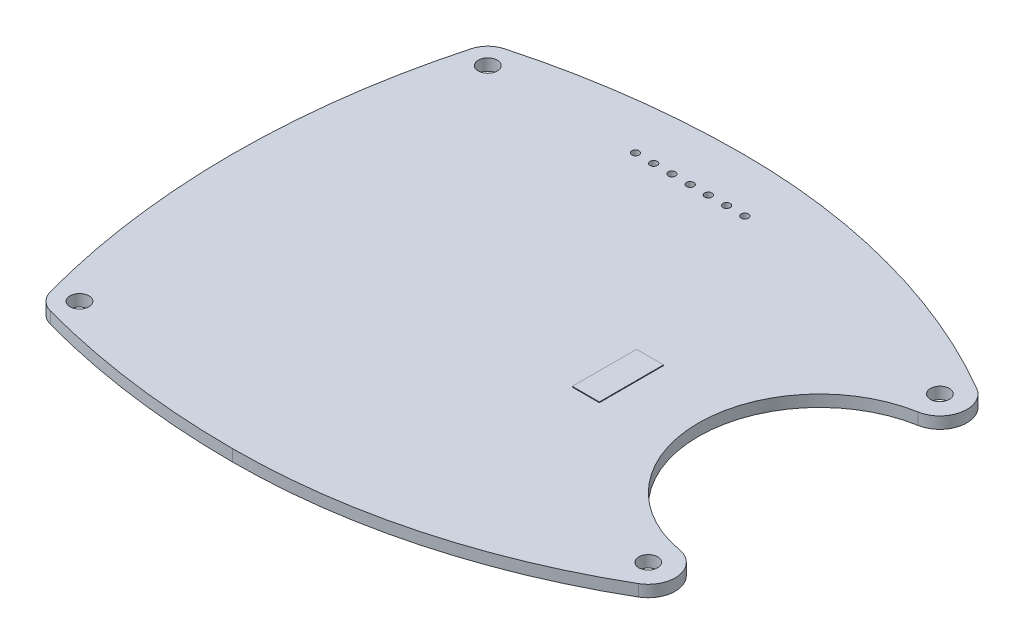
ISO-10303-21;
HEADER;
FILE_DESCRIPTION(('STEP AP214'),'2;1');
FILE_NAME('part.step','',(''),(''),'','','');
FILE_SCHEMA(('AUTOMOTIVE_DESIGN { 1 0 10303 214 1 1 1 1 }'));
ENDSEC;
DATA;
#1=APPLICATION_CONTEXT('core data for automotive mechanical design processes');
#2=APPLICATION_PROTOCOL_DEFINITION('international standard','automotive_design',2000,#1);
#3=PRODUCT_CONTEXT('',#1,'mechanical');
#4=PRODUCT('Part','Part','',(#3));
#5=PRODUCT_RELATED_PRODUCT_CATEGORY('part','',(#4));
#6=PRODUCT_DEFINITION_FORMATION('','',#4);
#7=PRODUCT_DEFINITION_CONTEXT('part definition',#1,'design');
#8=PRODUCT_DEFINITION('design','',#6,#7);
#9=PRODUCT_DEFINITION_SHAPE('','',#8);
#10=(LENGTH_UNIT() NAMED_UNIT(*) SI_UNIT(.MILLI.,.METRE.));
#11=(NAMED_UNIT(*) PLANE_ANGLE_UNIT() SI_UNIT($,.RADIAN.));
#12=(NAMED_UNIT(*) SI_UNIT($,.STERADIAN.) SOLID_ANGLE_UNIT());
#13=UNCERTAINTY_MEASURE_WITH_UNIT(LENGTH_MEASURE(1.E-05),#10,'distance_accuracy_value','');
#14=(GEOMETRIC_REPRESENTATION_CONTEXT(3) GLOBAL_UNCERTAINTY_ASSIGNED_CONTEXT((#13)) GLOBAL_UNIT_ASSIGNED_CONTEXT((#10,
#11,#12)) REPRESENTATION_CONTEXT('',''));
#15=CARTESIAN_POINT('',(0.,0.,0.));
#16=DIRECTION('',(0.,0.,1.));
#17=DIRECTION('',(1.,0.,0.));
#18=AXIS2_PLACEMENT_3D('',#15,#16,#17);
#19=CARTESIAN_POINT('',(0.,1.7,0.));
#20=DIRECTION('',(0.,-1.,0.));
#21=DIRECTION('',(0.,0.,-1.));
#22=AXIS2_PLACEMENT_3D('',#19,#20,#21);
#23=PLANE('',#22);
#24=DIRECTION('',(0.,0.,-1.));
#25=VECTOR('',#24,1.);
#26=CARTESIAN_POINT('',(16.,1.7,4.4));
#27=LINE('',#26,#25);
#28=CARTESIAN_POINT('',(16.,1.7,4.4));
#29=VERTEX_POINT('',#28);
#30=CARTESIAN_POINT('',(16.,1.7,-4.4));
#31=VERTEX_POINT('',#30);
#32=EDGE_CURVE('E214',#29,#31,#27,.T.);
#33=ORIENTED_EDGE('',*,*,#32,.F.);
#34=DIRECTION('',(-1.,0.,0.));
#35=VECTOR('',#34,1.);
#36=CARTESIAN_POINT('',(16.,1.7,4.4));
#37=LINE('',#36,#35);
#38=CARTESIAN_POINT('',(19.7,1.7,4.4));
#39=VERTEX_POINT('',#38);
#40=EDGE_CURVE('E219',#39,#29,#37,.T.);
#41=ORIENTED_EDGE('',*,*,#40,.F.);
#42=DIRECTION('',(0.,0.,1.));
#43=VECTOR('',#42,1.);
#44=CARTESIAN_POINT('',(19.7,1.7,4.4));
#45=LINE('',#44,#43);
#46=CARTESIAN_POINT('',(19.7,1.7,-4.4));
#47=VERTEX_POINT('',#46);
#48=EDGE_CURVE('E224',#47,#39,#45,.T.);
#49=ORIENTED_EDGE('',*,*,#48,.F.);
#50=DIRECTION('',(1.,0.,0.));
#51=VECTOR('',#50,1.);
#52=CARTESIAN_POINT('',(16.,1.7,-4.4));
#53=LINE('',#52,#51);
#54=EDGE_CURVE('E208',#31,#47,#53,.T.);
#55=ORIENTED_EDGE('',*,*,#54,.F.);
#56=EDGE_LOOP('',(#33,#41,#49,#55));
#57=FACE_BOUND('',#56,.T.);
#58=ADVANCED_FACE('F16',(#57),#23,.F.);
#59=CARTESIAN_POINT('',(0.,-3.,0.));
#60=DIRECTION('',(0.,1.,0.));
#61=DIRECTION('',(0.,0.,1.));
#62=AXIS2_PLACEMENT_3D('',#59,#60,#61);
#63=PLANE('',#62);
#64=DIRECTION('',(0.,0.,-1.));
#65=VECTOR('',#64,1.);
#66=CARTESIAN_POINT('',(11.002365618,-3.,-5.5));
#67=LINE('',#66,#65);
#68=CARTESIAN_POINT('',(11.002365618,-3.,-5.5));
#69=VERTEX_POINT('',#68);
#70=CARTESIAN_POINT('',(11.002365618,-3.,5.5));
#71=VERTEX_POINT('',#70);
#72=EDGE_CURVE('E165',#69,#71,#67,.F.);
#73=ORIENTED_EDGE('',*,*,#72,.F.);
#74=DIRECTION('',(1.,0.,0.));
#75=VECTOR('',#74,1.);
#76=CARTESIAN_POINT('',(11.002365618,-3.,-5.5));
#77=LINE('',#76,#75);
#78=CARTESIAN_POINT('',(16.002365618,-3.,-5.5));
#79=VERTEX_POINT('',#78);
#80=EDGE_CURVE('E177',#79,#69,#77,.F.);
#81=ORIENTED_EDGE('',*,*,#80,.F.);
#82=DIRECTION('',(0.,0.,1.));
#83=VECTOR('',#82,1.);
#84=CARTESIAN_POINT('',(16.002365618,-3.,-5.5));
#85=LINE('',#84,#83);
#86=CARTESIAN_POINT('',(16.002365618,-3.,5.5));
#87=VERTEX_POINT('',#86);
#88=EDGE_CURVE('E182',#87,#79,#85,.F.);
#89=ORIENTED_EDGE('',*,*,#88,.F.);
#90=DIRECTION('',(-1.,0.,0.));
#91=VECTOR('',#90,1.);
#92=CARTESIAN_POINT('',(11.002365618,-3.,5.5));
#93=LINE('',#92,#91);
#94=EDGE_CURVE('E148',#71,#87,#93,.F.);
#95=ORIENTED_EDGE('',*,*,#94,.F.);
#96=EDGE_LOOP('',(#73,#81,#89,#95));
#97=FACE_BOUND('',#96,.T.);
#98=ADVANCED_FACE('F472',(#97),#63,.F.);
#99=CARTESIAN_POINT('',(19.7,1.7,4.4));
#100=DIRECTION('',(-1.,0.,0.));
#101=DIRECTION('',(0.,0.,1.));
#102=AXIS2_PLACEMENT_3D('',#99,#100,#101);
#103=PLANE('',#102);
#104=ORIENTED_EDGE('',*,*,#48,.T.);
#105=DIRECTION('',(0.,1.,0.));
#106=VECTOR('',#105,1.);
#107=CARTESIAN_POINT('',(19.7,1.7,4.4));
#108=LINE('',#107,#106);
#109=CARTESIAN_POINT('',(19.7,1.6,4.4));
#110=VERTEX_POINT('',#109);
#111=EDGE_CURVE('E221',#110,#39,#108,.T.);
#112=ORIENTED_EDGE('',*,*,#111,.F.);
#113=DIRECTION('',(0.,0.,-1.));
#114=VECTOR('',#113,1.);
#115=CARTESIAN_POINT('',(19.7,1.6,-23.329166667));
#116=LINE('',#115,#114);
#117=CARTESIAN_POINT('',(19.7,1.6,-4.4));
#118=VERTEX_POINT('',#117);
#119=EDGE_CURVE('E173',#118,#110,#116,.F.);
#120=ORIENTED_EDGE('',*,*,#119,.F.);
#121=DIRECTION('',(0.,1.,0.));
#122=VECTOR('',#121,1.);
#123=CARTESIAN_POINT('',(19.7,1.7,-4.4));
#124=LINE('',#123,#122);
#125=EDGE_CURVE('E205',#47,#118,#124,.F.);
#126=ORIENTED_EDGE('',*,*,#125,.F.);
#127=EDGE_LOOP('',(#104,#112,#120,#126));
#128=FACE_BOUND('',#127,.T.);
#129=ADVANCED_FACE('F469',(#128),#103,.F.);
#130=CARTESIAN_POINT('',(16.,1.7,4.4));
#131=DIRECTION('',(0.,0.,-1.));
#132=DIRECTION('',(-1.,0.,0.));
#133=AXIS2_PLACEMENT_3D('',#130,#131,#132);
#134=PLANE('',#133);
#135=ORIENTED_EDGE('',*,*,#40,.T.);
#136=DIRECTION('',(0.,1.,0.));
#137=VECTOR('',#136,1.);
#138=CARTESIAN_POINT('',(16.,1.7,4.4));
#139=LINE('',#138,#137);
#140=CARTESIAN_POINT('',(16.,1.6,4.4));
#141=VERTEX_POINT('',#140);
#142=EDGE_CURVE('E216',#141,#29,#139,.T.);
#143=ORIENTED_EDGE('',*,*,#142,.F.);
#144=DIRECTION('',(1.,0.,0.));
#145=VECTOR('',#144,1.);
#146=CARTESIAN_POINT('',(-14.,1.6,4.4));
#147=LINE('',#146,#145);
#148=EDGE_CURVE('E497',#110,#141,#147,.F.);
#149=ORIENTED_EDGE('',*,*,#148,.F.);
#150=ORIENTED_EDGE('',*,*,#111,.T.);
#151=EDGE_LOOP('',(#135,#143,#149,#150));
#152=FACE_BOUND('',#151,.T.);
#153=ADVANCED_FACE('F465',(#152),#134,.F.);
#154=CARTESIAN_POINT('',(16.,1.7,4.4));
#155=DIRECTION('',(1.,0.,0.));
#156=DIRECTION('',(0.,0.,-1.));
#157=AXIS2_PLACEMENT_3D('',#154,#155,#156);
#158=PLANE('',#157);
#159=ORIENTED_EDGE('',*,*,#32,.T.);
#160=DIRECTION('',(0.,1.,0.));
#161=VECTOR('',#160,1.);
#162=CARTESIAN_POINT('',(16.,1.7,-4.4));
#163=LINE('',#162,#161);
#164=CARTESIAN_POINT('',(16.,1.6,-4.4));
#165=VERTEX_POINT('',#164);
#166=EDGE_CURVE('E211',#165,#31,#163,.T.);
#167=ORIENTED_EDGE('',*,*,#166,.F.);
#168=DIRECTION('',(0.,0.,-1.));
#169=VECTOR('',#168,1.);
#170=CARTESIAN_POINT('',(16.,1.6,-23.329166667));
#171=LINE('',#170,#169);
#172=EDGE_CURVE('E495',#141,#165,#171,.T.);
#173=ORIENTED_EDGE('',*,*,#172,.F.);
#174=ORIENTED_EDGE('',*,*,#142,.T.);
#175=EDGE_LOOP('',(#159,#167,#173,#174));
#176=FACE_BOUND('',#175,.T.);
#177=ADVANCED_FACE('F461',(#176),#158,.F.);
#178=CARTESIAN_POINT('',(16.,1.7,-4.4));
#179=DIRECTION('',(0.,0.,1.));
#180=DIRECTION('',(1.,0.,0.));
#181=AXIS2_PLACEMENT_3D('',#178,#179,#180);
#182=PLANE('',#181);
#183=ORIENTED_EDGE('',*,*,#54,.T.);
#184=ORIENTED_EDGE('',*,*,#125,.T.);
#185=DIRECTION('',(1.,0.,0.));
#186=VECTOR('',#185,1.);
#187=CARTESIAN_POINT('',(-14.,1.6,-4.4));
#188=LINE('',#187,#186);
#189=EDGE_CURVE('E287',#165,#118,#188,.T.);
#190=ORIENTED_EDGE('',*,*,#189,.F.);
#191=ORIENTED_EDGE('',*,*,#166,.T.);
#192=EDGE_LOOP('',(#183,#184,#190,#191));
#193=FACE_BOUND('',#192,.T.);
#194=ADVANCED_FACE('F458',(#193),#182,.F.);
#195=CARTESIAN_POINT('',(0.,0.,-74.658333333));
#196=DIRECTION('',(0.,-1.,0.));
#197=DIRECTION('',(0.,0.,-1.));
#198=AXIS2_PLACEMENT_3D('',#195,#196,#197);
#199=CYLINDRICAL_SURFACE('',#198,109.658333334);
#200=CARTESIAN_POINT('',(0.,1.6000000003412,-74.658333333));
#201=DIRECTION('',(0.,-1.,0.));
#202=DIRECTION('',(0.,0.,-1.));
#203=AXIS2_PLACEMENT_3D('',#200,#201,#202);
#204=CIRCLE('',#203,109.658333334);
#205=CARTESIAN_POINT('',(-28.8551961782056,1.60000000016539,31.1354647980793));
#206=VERTEX_POINT('',#205);
#207=CARTESIAN_POINT('',(0.,1.60000000036999,35.000000001));
#208=VERTEX_POINT('',#207);
#209=EDGE_CURVE('E19',#206,#208,#204,.F.);
#210=ORIENTED_EDGE('',*,*,#209,.F.);
#211=DIRECTION('',(0.,1.,0.));
#212=VECTOR('',#211,1.);
#213=CARTESIAN_POINT('',(-28.8551961779043,0.8,31.1354647976493));
#214=LINE('',#213,#212);
#215=CARTESIAN_POINT('',(-28.8551961780756,1.65387491573494E-10,31.1354647976026));
#216=VERTEX_POINT('',#215);
#217=EDGE_CURVE('E203',#216,#206,#214,.T.);
#218=ORIENTED_EDGE('',*,*,#217,.F.);
#219=CARTESIAN_POINT('',(0.,3.41196038436409E-10,-74.658333333));
#220=DIRECTION('',(0.,-1.,0.));
#221=DIRECTION('',(0.,0.,-1.));
#222=AXIS2_PLACEMENT_3D('',#219,#220,#221);
#223=CIRCLE('',#222,109.658333334);
#224=CARTESIAN_POINT('',(0.,3.69995575651017E-10,35.000000001));
#225=VERTEX_POINT('',#224);
#226=EDGE_CURVE('E144',#225,#216,#223,.T.);
#227=ORIENTED_EDGE('',*,*,#226,.F.);
#228=DIRECTION('',(0.,-1.,0.));
#229=VECTOR('',#228,1.);
#230=CARTESIAN_POINT('',(0.,0.8,35.000000001));
#231=LINE('',#230,#229);
#232=EDGE_CURVE('E140',#208,#225,#231,.T.);
#233=ORIENTED_EDGE('',*,*,#232,.F.);
#234=EDGE_LOOP('',(#210,#218,#227,#233));
#235=FACE_BOUND('',#234,.T.);
#236=ADVANCED_FACE('F142',(#235),#199,.T.);
#237=CARTESIAN_POINT('',(-28.,0.,28.));
#238=DIRECTION('',(0.,-1.,0.));
#239=DIRECTION('',(0.,0.,-1.));
#240=AXIS2_PLACEMENT_3D('',#237,#238,#239);
#241=CYLINDRICAL_SURFACE('',#240,3.25);
#242=CARTESIAN_POINT('',(-28.,1.6,28.));
#243=DIRECTION('',(0.,-1.,0.));
#244=DIRECTION('',(0.,0.,-1.));
#245=AXIS2_PLACEMENT_3D('',#242,#243,#244);
#246=CIRCLE('',#245,3.25);
#247=CARTESIAN_POINT('',(-31.1354647975969,1.6,28.855196178074));
#248=VERTEX_POINT('',#247);
#249=EDGE_CURVE('E162',#248,#206,#246,.F.);
#250=ORIENTED_EDGE('',*,*,#249,.F.);
#251=DIRECTION('',(0.,1.,0.));
#252=VECTOR('',#251,1.);
#253=CARTESIAN_POINT('',(-31.1354647976379,0.8,28.8551961779013));
#254=LINE('',#253,#252);
#255=CARTESIAN_POINT('',(-31.1354647975912,0.,28.8551961780725));
#256=VERTEX_POINT('',#255);
#257=EDGE_CURVE('E201',#256,#248,#254,.T.);
#258=ORIENTED_EDGE('',*,*,#257,.F.);
#259=CARTESIAN_POINT('',(-28.,0.,28.));
#260=DIRECTION('',(0.,-1.,0.));
#261=DIRECTION('',(0.,0.,-1.));
#262=AXIS2_PLACEMENT_3D('',#259,#260,#261);
#263=CIRCLE('',#262,3.25);
#264=EDGE_CURVE('E283',#216,#256,#263,.T.);
#265=ORIENTED_EDGE('',*,*,#264,.F.);
#266=ORIENTED_EDGE('',*,*,#217,.T.);
#267=EDGE_LOOP('',(#250,#258,#265,#266));
#268=FACE_BOUND('',#267,.T.);
#269=ADVANCED_FACE('F365',(#268),#241,.T.);
#270=CARTESIAN_POINT('',(74.658333333,0.,0.));
#271=DIRECTION('',(0.,-1.,0.));
#272=DIRECTION('',(0.,0.,-1.));
#273=AXIS2_PLACEMENT_3D('',#270,#271,#272);
#274=CYLINDRICAL_SURFACE('',#273,109.658333333);
#275=CARTESIAN_POINT('',(74.658333333,1.6,0.));
#276=DIRECTION('',(0.,-1.,0.));
#277=DIRECTION('',(0.,0.,-1.));
#278=AXIS2_PLACEMENT_3D('',#275,#276,#277);
#279=CIRCLE('',#278,109.658333333);
#280=CARTESIAN_POINT('',(-31.1354647975969,1.6,-28.855196178074));
#281=VERTEX_POINT('',#280);
#282=EDGE_CURVE('E319',#281,#248,#279,.F.);
#283=ORIENTED_EDGE('',*,*,#282,.F.);
#284=DIRECTION('',(0.,1.,0.));
#285=VECTOR('',#284,1.);
#286=CARTESIAN_POINT('',(-31.1354647976493,0.8,-28.8551961779043));
#287=LINE('',#286,#285);
#288=CARTESIAN_POINT('',(-31.1354647976026,0.,-28.8551961780756));
#289=VERTEX_POINT('',#288);
#290=EDGE_CURVE('E199',#289,#281,#287,.T.);
#291=ORIENTED_EDGE('',*,*,#290,.F.);
#292=CARTESIAN_POINT('',(74.658333333,0.,0.));
#293=DIRECTION('',(0.,-1.,0.));
#294=DIRECTION('',(0.,0.,-1.));
#295=AXIS2_PLACEMENT_3D('',#292,#293,#294);
#296=CIRCLE('',#295,109.658333333);
#297=EDGE_CURVE('E280',#256,#289,#296,.T.);
#298=ORIENTED_EDGE('',*,*,#297,.F.);
#299=ORIENTED_EDGE('',*,*,#257,.T.);
#300=EDGE_LOOP('',(#283,#291,#298,#299));
#301=FACE_BOUND('',#300,.T.);
#302=ADVANCED_FACE('F361',(#301),#274,.T.);
#303=CARTESIAN_POINT('',(-28.,0.,-28.));
#304=DIRECTION('',(0.,-1.,0.));
#305=DIRECTION('',(0.,0.,-1.));
#306=AXIS2_PLACEMENT_3D('',#303,#304,#305);
#307=CYLINDRICAL_SURFACE('',#306,3.25);
#308=CARTESIAN_POINT('',(-28.,1.6,-28.));
#309=DIRECTION('',(0.,-1.,0.));
#310=DIRECTION('',(0.,0.,-1.));
#311=AXIS2_PLACEMENT_3D('',#308,#309,#310);
#312=CIRCLE('',#311,3.25);
#313=CARTESIAN_POINT('',(-28.855196178074,1.59999999983844,-31.1354647975969));
#314=VERTEX_POINT('',#313);
#315=EDGE_CURVE('E321',#314,#281,#312,.F.);
#316=ORIENTED_EDGE('',*,*,#315,.F.);
#317=DIRECTION('',(0.,1.,0.));
#318=VECTOR('',#317,1.);
#319=CARTESIAN_POINT('',(-28.8551961779013,0.8,-31.1354647976379));
#320=LINE('',#319,#318);
#321=CARTESIAN_POINT('',(-28.8551961780725,-1.61557433145747E-10,-31.1354647975912));
#322=VERTEX_POINT('',#321);
#323=EDGE_CURVE('E197',#322,#314,#320,.T.);
#324=ORIENTED_EDGE('',*,*,#323,.F.);
#325=CARTESIAN_POINT('',(-28.,0.,-28.));
#326=DIRECTION('',(0.,-1.,0.));
#327=DIRECTION('',(0.,0.,-1.));
#328=AXIS2_PLACEMENT_3D('',#325,#326,#327);
#329=CIRCLE('',#328,3.25);
#330=EDGE_CURVE('E277',#289,#322,#329,.T.);
#331=ORIENTED_EDGE('',*,*,#330,.F.);
#332=ORIENTED_EDGE('',*,*,#290,.T.);
#333=EDGE_LOOP('',(#316,#324,#331,#332));
#334=FACE_BOUND('',#333,.T.);
#335=ADVANCED_FACE('F358',(#334),#307,.T.);
#336=CARTESIAN_POINT('',(0.,0.,74.658333333));
#337=DIRECTION('',(0.,-1.,0.));
#338=DIRECTION('',(0.,0.,-1.));
#339=AXIS2_PLACEMENT_3D('',#336,#337,#338);
#340=CYLINDRICAL_SURFACE('',#339,109.658333333);
#341=CARTESIAN_POINT('',(0.,1.5999999996667,74.658333333));
#342=DIRECTION('',(0.,-1.,0.));
#343=DIRECTION('',(0.,0.,-1.));
#344=AXIS2_PLACEMENT_3D('',#341,#342,#343);
#345=CIRCLE('',#344,109.658333333);
#346=CARTESIAN_POINT('',(0.,1.59999999961845,-35.));
#347=VERTEX_POINT('',#346);
#348=EDGE_CURVE('E324',#347,#314,#345,.F.);
#349=ORIENTED_EDGE('',*,*,#348,.F.);
#350=DIRECTION('',(0.,1.,0.));
#351=VECTOR('',#350,1.);
#352=CARTESIAN_POINT('',(0.,0.8,-35.));
#353=LINE('',#352,#351);
#354=CARTESIAN_POINT('',(0.,-3.81550445607022E-10,-35.));
#355=VERTEX_POINT('',#354);
#356=EDGE_CURVE('E195',#355,#347,#353,.T.);
#357=ORIENTED_EDGE('',*,*,#356,.F.);
#358=CARTESIAN_POINT('',(0.,-3.33294589843769E-10,74.658333333));
#359=DIRECTION('',(0.,-1.,0.));
#360=DIRECTION('',(0.,0.,-1.));
#361=AXIS2_PLACEMENT_3D('',#358,#359,#360);
#362=CIRCLE('',#361,109.658333333);
#363=EDGE_CURVE('E274',#322,#355,#362,.T.);
#364=ORIENTED_EDGE('',*,*,#363,.F.);
#365=ORIENTED_EDGE('',*,*,#323,.T.);
#366=EDGE_LOOP('',(#349,#357,#364,#365));
#367=FACE_BOUND('',#366,.T.);
#368=ADVANCED_FACE('F354',(#367),#340,.T.);
#369=CARTESIAN_POINT('',(0.,0.,52.389705882));
#370=DIRECTION('',(0.,-1.,0.));
#371=DIRECTION('',(0.,0.,-1.));
#372=AXIS2_PLACEMENT_3D('',#369,#370,#371);
#373=CYLINDRICAL_SURFACE('',#372,87.389705882);
#374=CARTESIAN_POINT('',(0.,1.5999999996471,52.389705882));
#375=DIRECTION('',(0.,-1.,0.));
#376=DIRECTION('',(0.,0.,-1.));
#377=AXIS2_PLACEMENT_3D('',#374,#375,#376);
#378=CIRCLE('',#377,87.389705882);
#379=CARTESIAN_POINT('',(43.8559116820076,1.59999999983135,-23.1987833522387));
#380=VERTEX_POINT('',#379);
#381=EDGE_CURVE('E327',#380,#347,#378,.F.);
#382=ORIENTED_EDGE('',*,*,#381,.F.);
#383=DIRECTION('',(0.,1.,0.));
#384=VECTOR('',#383,1.);
#385=CARTESIAN_POINT('',(43.855911682198,0.8,-23.1987833523412));
#386=LINE('',#385,#384);
#387=CARTESIAN_POINT('',(43.8559116821001,-1.68649853062362E-10,-23.198783352398));
#388=VERTEX_POINT('',#387);
#389=EDGE_CURVE('E193',#388,#380,#386,.T.);
#390=ORIENTED_EDGE('',*,*,#389,.F.);
#391=CARTESIAN_POINT('',(0.,-3.52893495675355E-10,52.389705882));
#392=DIRECTION('',(0.,-1.,0.));
#393=DIRECTION('',(0.,0.,-1.));
#394=AXIS2_PLACEMENT_3D('',#391,#392,#393);
#395=CIRCLE('',#394,87.389705882);
#396=EDGE_CURVE('E271',#355,#388,#395,.T.);
#397=ORIENTED_EDGE('',*,*,#396,.F.);
#398=ORIENTED_EDGE('',*,*,#356,.T.);
#399=EDGE_LOOP('',(#382,#390,#397,#398));
#400=FACE_BOUND('',#399,.T.);
#401=ADVANCED_FACE('F350',(#400),#373,.T.);
#402=CARTESIAN_POINT('',(42.,0.,-20.));
#403=DIRECTION('',(0.,-1.,0.));
#404=DIRECTION('',(0.,0.,-1.));
#405=AXIS2_PLACEMENT_3D('',#402,#403,#404);
#406=CYLINDRICAL_SURFACE('',#405,3.69819187);
#407=CARTESIAN_POINT('',(42.,1.6,-20.));
#408=DIRECTION('',(0.,-1.,0.));
#409=DIRECTION('',(0.,0.,-1.));
#410=AXIS2_PLACEMENT_3D('',#407,#408,#409);
#411=CIRCLE('',#410,3.69819187);
#412=CARTESIAN_POINT('',(42.6374955411872,1.6,-16.3571683350015));
#413=VERTEX_POINT('',#412);
#414=EDGE_CURVE('E330',#413,#380,#411,.F.);
#415=ORIENTED_EDGE('',*,*,#414,.F.);
#416=DIRECTION('',(0.,1.,0.));
#417=VECTOR('',#416,1.);
#418=CARTESIAN_POINT('',(42.6374955409404,0.8,-16.3571683353406));
#419=LINE('',#418,#417);
#420=CARTESIAN_POINT('',(42.6374955411223,0.,-16.3571683353724));
#421=VERTEX_POINT('',#420);
#422=EDGE_CURVE('E191',#421,#413,#419,.T.);
#423=ORIENTED_EDGE('',*,*,#422,.F.);
#424=CARTESIAN_POINT('',(42.,0.,-20.));
#425=DIRECTION('',(0.,-1.,0.));
#426=DIRECTION('',(0.,0.,-1.));
#427=AXIS2_PLACEMENT_3D('',#424,#425,#426);
#428=CIRCLE('',#427,3.69819187);
#429=EDGE_CURVE('E268',#388,#421,#428,.T.);
#430=ORIENTED_EDGE('',*,*,#429,.F.);
#431=ORIENTED_EDGE('',*,*,#389,.T.);
#432=EDGE_LOOP('',(#415,#423,#430,#431));
#433=FACE_BOUND('',#432,.T.);
#434=ADVANCED_FACE('F346',(#433),#406,.T.);
#435=CARTESIAN_POINT('',(45.5,1.6,0.));
#436=DIRECTION('',(0.,-1.,0.));
#437=DIRECTION('',(0.,0.,-1.));
#438=AXIS2_PLACEMENT_3D('',#435,#436,#437);
#439=CYLINDRICAL_SURFACE('',#438,16.605748635);
#440=CARTESIAN_POINT('',(45.5,1.6,0.));
#441=DIRECTION('',(0.,-1.,0.));
#442=DIRECTION('',(0.,0.,-1.));
#443=AXIS2_PLACEMENT_3D('',#440,#441,#442);
#444=CIRCLE('',#443,16.605748635);
#445=CARTESIAN_POINT('',(42.6374955411872,1.6,16.3571683350015));
#446=VERTEX_POINT('',#445);
#447=EDGE_CURVE('E333',#446,#413,#444,.T.);
#448=ORIENTED_EDGE('',*,*,#447,.F.);
#449=DIRECTION('',(0.,1.,0.));
#450=VECTOR('',#449,1.);
#451=CARTESIAN_POINT('',(42.6374955410702,0.8,16.3571683345988));
#452=LINE('',#451,#450);
#453=CARTESIAN_POINT('',(42.6374955412521,0.,16.3571683346306));
#454=VERTEX_POINT('',#453);
#455=EDGE_CURVE('E189',#454,#446,#452,.T.);
#456=ORIENTED_EDGE('',*,*,#455,.F.);
#457=CARTESIAN_POINT('',(45.5,0.,0.));
#458=DIRECTION('',(0.,-1.,0.));
#459=DIRECTION('',(0.,0.,-1.));
#460=AXIS2_PLACEMENT_3D('',#457,#458,#459);
#461=CIRCLE('',#460,16.605748635);
#462=EDGE_CURVE('E265',#421,#454,#461,.F.);
#463=ORIENTED_EDGE('',*,*,#462,.F.);
#464=ORIENTED_EDGE('',*,*,#422,.T.);
#465=EDGE_LOOP('',(#448,#456,#463,#464));
#466=FACE_BOUND('',#465,.T.);
#467=ADVANCED_FACE('F342',(#466),#439,.F.);
#468=CARTESIAN_POINT('',(42.,0.,20.));
#469=DIRECTION('',(0.,-1.,0.));
#470=DIRECTION('',(0.,0.,-1.));
#471=AXIS2_PLACEMENT_3D('',#468,#469,#470);
#472=CYLINDRICAL_SURFACE('',#471,3.69819187);
#473=CARTESIAN_POINT('',(42.,1.6,20.));
#474=DIRECTION('',(0.,-1.,0.));
#475=DIRECTION('',(0.,0.,-1.));
#476=AXIS2_PLACEMENT_3D('',#473,#474,#475);
#477=CIRCLE('',#476,3.69819187);
#478=CARTESIAN_POINT('',(43.8559116822585,1.60000000016865,23.1987833526711));
#479=VERTEX_POINT('',#478);
#480=EDGE_CURVE('E157',#479,#446,#477,.F.);
#481=ORIENTED_EDGE('',*,*,#480,.F.);
#482=DIRECTION('',(0.,1.,0.));
#483=VECTOR('',#482,1.);
#484=CARTESIAN_POINT('',(43.8559116825149,0.8,23.1987833528874));
#485=LINE('',#484,#483);
#486=CARTESIAN_POINT('',(43.855911682417,1.68649542173118E-10,23.1987833529442));
#487=VERTEX_POINT('',#486);
#488=EDGE_CURVE('E149',#487,#479,#485,.T.);
#489=ORIENTED_EDGE('',*,*,#488,.F.);
#490=CARTESIAN_POINT('',(42.,0.,20.));
#491=DIRECTION('',(0.,-1.,0.));
#492=DIRECTION('',(0.,0.,-1.));
#493=AXIS2_PLACEMENT_3D('',#490,#491,#492);
#494=CIRCLE('',#493,3.69819187);
#495=EDGE_CURVE('E262',#454,#487,#494,.T.);
#496=ORIENTED_EDGE('',*,*,#495,.F.);
#497=ORIENTED_EDGE('',*,*,#455,.T.);
#498=EDGE_LOOP('',(#481,#489,#496,#497));
#499=FACE_BOUND('',#498,.T.);
#500=ADVANCED_FACE('F338',(#499),#472,.T.);
#501=CARTESIAN_POINT('',(0.,0.,-52.389705882));
#502=DIRECTION('',(0.,-1.,0.));
#503=DIRECTION('',(0.,0.,-1.));
#504=AXIS2_PLACEMENT_3D('',#501,#502,#503);
#505=CYLINDRICAL_SURFACE('',#504,87.389705883);
#506=CARTESIAN_POINT('',(0.,1.6000000003529,-52.389705882));
#507=DIRECTION('',(0.,-1.,0.));
#508=DIRECTION('',(0.,0.,-1.));
#509=AXIS2_PLACEMENT_3D('',#506,#507,#508);
#510=CIRCLE('',#509,87.389705883);
#511=EDGE_CURVE('E152',#208,#479,#510,.F.);
#512=ORIENTED_EDGE('',*,*,#511,.F.);
#513=ORIENTED_EDGE('',*,*,#232,.T.);
#514=CARTESIAN_POINT('',(0.,3.52892845154051E-10,-52.389705882));
#515=DIRECTION('',(0.,-1.,0.));
#516=DIRECTION('',(0.,0.,-1.));
#517=AXIS2_PLACEMENT_3D('',#514,#515,#516);
#518=CIRCLE('',#517,87.389705883);
#519=EDGE_CURVE('E260',#487,#225,#518,.T.);
#520=ORIENTED_EDGE('',*,*,#519,.F.);
#521=ORIENTED_EDGE('',*,*,#488,.T.);
#522=EDGE_LOOP('',(#512,#513,#520,#521));
#523=FACE_BOUND('',#522,.T.);
#524=ADVANCED_FACE('F153',(#523),#505,.T.);
#525=CARTESIAN_POINT('',(5.,1.6,-27.75));
#526=DIRECTION('',(0.,-1.,0.));
#527=DIRECTION('',(0.,0.,-1.));
#528=AXIS2_PLACEMENT_3D('',#525,#526,#527);
#529=CYLINDRICAL_SURFACE('',#528,0.5);
#530=CARTESIAN_POINT('',(5.,0.,-27.75));
#531=DIRECTION('',(0.,-1.,0.));
#532=DIRECTION('',(0.,0.,-1.));
#533=AXIS2_PLACEMENT_3D('',#530,#531,#532);
#534=CIRCLE('',#533,0.5);
#535=CARTESIAN_POINT('',(5.,0.,-28.25));
#536=VERTEX_POINT('',#535);
#537=EDGE_CURVE('E257',#536,#536,#534,.F.);
#538=ORIENTED_EDGE('',*,*,#537,.F.);
#539=EDGE_LOOP('',(#538));
#540=FACE_BOUND('',#539,.T.);
#541=CARTESIAN_POINT('',(5.,1.6,-27.75));
#542=DIRECTION('',(0.,-1.,0.));
#543=DIRECTION('',(0.,0.,-1.));
#544=AXIS2_PLACEMENT_3D('',#541,#542,#543);
#545=CIRCLE('',#544,0.5);
#546=CARTESIAN_POINT('',(5.,1.6,-28.25));
#547=VERTEX_POINT('',#546);
#548=EDGE_CURVE('E315',#547,#547,#545,.T.);
#549=ORIENTED_EDGE('',*,*,#548,.F.);
#550=EDGE_LOOP('',(#549));
#551=FACE_BOUND('',#550,.T.);
#552=ADVANCED_FACE('F433',(#540,#551),#529,.F.);
#553=CARTESIAN_POINT('',(2.5,1.6,-27.75));
#554=DIRECTION('',(0.,-1.,0.));
#555=DIRECTION('',(0.,0.,-1.));
#556=AXIS2_PLACEMENT_3D('',#553,#554,#555);
#557=CYLINDRICAL_SURFACE('',#556,0.5);
#558=CARTESIAN_POINT('',(2.5,0.,-27.75));
#559=DIRECTION('',(0.,-1.,0.));
#560=DIRECTION('',(0.,0.,-1.));
#561=AXIS2_PLACEMENT_3D('',#558,#559,#560);
#562=CIRCLE('',#561,0.5);
#563=CARTESIAN_POINT('',(2.5,0.,-28.25));
#564=VERTEX_POINT('',#563);
#565=EDGE_CURVE('E254',#564,#564,#562,.F.);
#566=ORIENTED_EDGE('',*,*,#565,.F.);
#567=EDGE_LOOP('',(#566));
#568=FACE_BOUND('',#567,.T.);
#569=CARTESIAN_POINT('',(2.5,1.6,-27.75));
#570=DIRECTION('',(0.,-1.,0.));
#571=DIRECTION('',(0.,0.,-1.));
#572=AXIS2_PLACEMENT_3D('',#569,#570,#571);
#573=CIRCLE('',#572,0.5);
#574=CARTESIAN_POINT('',(2.5,1.6,-28.25));
#575=VERTEX_POINT('',#574);
#576=EDGE_CURVE('E312',#575,#575,#573,.T.);
#577=ORIENTED_EDGE('',*,*,#576,.F.);
#578=EDGE_LOOP('',(#577));
#579=FACE_BOUND('',#578,.T.);
#580=ADVANCED_FACE('F429',(#568,#579),#557,.F.);
#581=CARTESIAN_POINT('',(-7.5,1.6,-27.75));
#582=DIRECTION('',(0.,-1.,0.));
#583=DIRECTION('',(0.,0.,-1.));
#584=AXIS2_PLACEMENT_3D('',#581,#582,#583);
#585=CYLINDRICAL_SURFACE('',#584,0.5);
#586=CARTESIAN_POINT('',(-7.5,0.,-27.75));
#587=DIRECTION('',(0.,-1.,0.));
#588=DIRECTION('',(0.,0.,-1.));
#589=AXIS2_PLACEMENT_3D('',#586,#587,#588);
#590=CIRCLE('',#589,0.5);
#591=CARTESIAN_POINT('',(-7.5,0.,-28.25));
#592=VERTEX_POINT('',#591);
#593=EDGE_CURVE('E251',#592,#592,#590,.F.);
#594=ORIENTED_EDGE('',*,*,#593,.F.);
#595=EDGE_LOOP('',(#594));
#596=FACE_BOUND('',#595,.T.);
#597=CARTESIAN_POINT('',(-7.5,1.6,-27.75));
#598=DIRECTION('',(0.,-1.,0.));
#599=DIRECTION('',(0.,0.,-1.));
#600=AXIS2_PLACEMENT_3D('',#597,#598,#599);
#601=CIRCLE('',#600,0.5);
#602=CARTESIAN_POINT('',(-7.5,1.6,-28.25));
#603=VERTEX_POINT('',#602);
#604=EDGE_CURVE('E309',#603,#603,#601,.T.);
#605=ORIENTED_EDGE('',*,*,#604,.F.);
#606=EDGE_LOOP('',(#605));
#607=FACE_BOUND('',#606,.T.);
#608=ADVANCED_FACE('F425',(#596,#607),#585,.F.);
#609=CARTESIAN_POINT('',(-5.,1.6,-27.75));
#610=DIRECTION('',(0.,-1.,0.));
#611=DIRECTION('',(0.,0.,-1.));
#612=AXIS2_PLACEMENT_3D('',#609,#610,#611);
#613=CYLINDRICAL_SURFACE('',#612,0.5);
#614=CARTESIAN_POINT('',(-5.,0.,-27.75));
#615=DIRECTION('',(0.,-1.,0.));
#616=DIRECTION('',(0.,0.,-1.));
#617=AXIS2_PLACEMENT_3D('',#614,#615,#616);
#618=CIRCLE('',#617,0.5);
#619=CARTESIAN_POINT('',(-5.,0.,-28.25));
#620=VERTEX_POINT('',#619);
#621=EDGE_CURVE('E248',#620,#620,#618,.F.);
#622=ORIENTED_EDGE('',*,*,#621,.F.);
#623=EDGE_LOOP('',(#622));
#624=FACE_BOUND('',#623,.T.);
#625=CARTESIAN_POINT('',(-5.,1.6,-27.75));
#626=DIRECTION('',(0.,-1.,0.));
#627=DIRECTION('',(0.,0.,-1.));
#628=AXIS2_PLACEMENT_3D('',#625,#626,#627);
#629=CIRCLE('',#628,0.5);
#630=CARTESIAN_POINT('',(-5.,1.6,-28.25));
#631=VERTEX_POINT('',#630);
#632=EDGE_CURVE('E306',#631,#631,#629,.T.);
#633=ORIENTED_EDGE('',*,*,#632,.F.);
#634=EDGE_LOOP('',(#633));
#635=FACE_BOUND('',#634,.T.);
#636=ADVANCED_FACE('F421',(#624,#635),#613,.F.);
#637=CARTESIAN_POINT('',(-2.5,1.6,-27.75));
#638=DIRECTION('',(0.,-1.,0.));
#639=DIRECTION('',(0.,0.,-1.));
#640=AXIS2_PLACEMENT_3D('',#637,#638,#639);
#641=CYLINDRICAL_SURFACE('',#640,0.5);
#642=CARTESIAN_POINT('',(-2.5,0.,-27.75));
#643=DIRECTION('',(0.,-1.,0.));
#644=DIRECTION('',(0.,0.,-1.));
#645=AXIS2_PLACEMENT_3D('',#642,#643,#644);
#646=CIRCLE('',#645,0.5);
#647=CARTESIAN_POINT('',(-2.5,0.,-28.25));
#648=VERTEX_POINT('',#647);
#649=EDGE_CURVE('E245',#648,#648,#646,.F.);
#650=ORIENTED_EDGE('',*,*,#649,.F.);
#651=EDGE_LOOP('',(#650));
#652=FACE_BOUND('',#651,.T.);
#653=CARTESIAN_POINT('',(-2.5,1.6,-27.75));
#654=DIRECTION('',(0.,-1.,0.));
#655=DIRECTION('',(0.,0.,-1.));
#656=AXIS2_PLACEMENT_3D('',#653,#654,#655);
#657=CIRCLE('',#656,0.5);
#658=CARTESIAN_POINT('',(-2.5,1.6,-28.25));
#659=VERTEX_POINT('',#658);
#660=EDGE_CURVE('E303',#659,#659,#657,.T.);
#661=ORIENTED_EDGE('',*,*,#660,.F.);
#662=EDGE_LOOP('',(#661));
#663=FACE_BOUND('',#662,.T.);
#664=ADVANCED_FACE('F417',(#652,#663),#641,.F.);
#665=CARTESIAN_POINT('',(0.,1.6,-27.75));
#666=DIRECTION('',(0.,-1.,0.));
#667=DIRECTION('',(0.,0.,-1.));
#668=AXIS2_PLACEMENT_3D('',#665,#666,#667);
#669=CYLINDRICAL_SURFACE('',#668,0.5);
#670=CARTESIAN_POINT('',(0.,0.,-27.75));
#671=DIRECTION('',(0.,-1.,0.));
#672=DIRECTION('',(0.,0.,-1.));
#673=AXIS2_PLACEMENT_3D('',#670,#671,#672);
#674=CIRCLE('',#673,0.5);
#675=CARTESIAN_POINT('',(0.,0.,-28.25));
#676=VERTEX_POINT('',#675);
#677=EDGE_CURVE('E242',#676,#676,#674,.F.);
#678=ORIENTED_EDGE('',*,*,#677,.F.);
#679=EDGE_LOOP('',(#678));
#680=FACE_BOUND('',#679,.T.);
#681=CARTESIAN_POINT('',(0.,1.6,-27.75));
#682=DIRECTION('',(0.,-1.,0.));
#683=DIRECTION('',(0.,0.,-1.));
#684=AXIS2_PLACEMENT_3D('',#681,#682,#683);
#685=CIRCLE('',#684,0.5);
#686=CARTESIAN_POINT('',(0.,1.6,-28.25));
#687=VERTEX_POINT('',#686);
#688=EDGE_CURVE('E300',#687,#687,#685,.T.);
#689=ORIENTED_EDGE('',*,*,#688,.F.);
#690=EDGE_LOOP('',(#689));
#691=FACE_BOUND('',#690,.T.);
#692=ADVANCED_FACE('F413',(#680,#691),#669,.F.);
#693=CARTESIAN_POINT('',(42.,1.6,-20.));
#694=DIRECTION('',(0.,-1.,0.));
#695=DIRECTION('',(0.,0.,-1.));
#696=AXIS2_PLACEMENT_3D('',#693,#694,#695);
#697=CYLINDRICAL_SURFACE('',#696,1.3);
#698=CARTESIAN_POINT('',(42.,1.6,-20.));
#699=DIRECTION('',(0.,-1.,0.));
#700=DIRECTION('',(0.,0.,-1.));
#701=AXIS2_PLACEMENT_3D('',#698,#699,#700);
#702=CIRCLE('',#701,1.3);
#703=CARTESIAN_POINT('',(42.,1.6,-21.3));
#704=VERTEX_POINT('',#703);
#705=EDGE_CURVE('E288',#704,#704,#702,.T.);
#706=ORIENTED_EDGE('',*,*,#705,.F.);
#707=EDGE_LOOP('',(#706));
#708=FACE_BOUND('',#707,.T.);
#709=CARTESIAN_POINT('',(42.,0.,-20.));
#710=DIRECTION('',(0.,-1.,0.));
#711=DIRECTION('',(0.,0.,-1.));
#712=AXIS2_PLACEMENT_3D('',#709,#710,#711);
#713=CIRCLE('',#712,1.3);
#714=CARTESIAN_POINT('',(42.,0.,-21.3));
#715=VERTEX_POINT('',#714);
#716=EDGE_CURVE('E239',#715,#715,#713,.F.);
#717=ORIENTED_EDGE('',*,*,#716,.F.);
#718=EDGE_LOOP('',(#717));
#719=FACE_BOUND('',#718,.T.);
#720=ADVANCED_FACE('F409',(#708,#719),#697,.F.);
#721=CARTESIAN_POINT('',(-28.,1.6,-28.));
#722=DIRECTION('',(0.,-1.,0.));
#723=DIRECTION('',(0.,0.,-1.));
#724=AXIS2_PLACEMENT_3D('',#721,#722,#723);
#725=CYLINDRICAL_SURFACE('',#724,1.3);
#726=CARTESIAN_POINT('',(-28.,1.6,-28.));
#727=DIRECTION('',(0.,-1.,0.));
#728=DIRECTION('',(0.,0.,-1.));
#729=AXIS2_PLACEMENT_3D('',#726,#727,#728);
#730=CIRCLE('',#729,1.3);
#731=CARTESIAN_POINT('',(-28.,1.6,-29.3));
#732=VERTEX_POINT('',#731);
#733=EDGE_CURVE('E291',#732,#732,#730,.T.);
#734=ORIENTED_EDGE('',*,*,#733,.F.);
#735=EDGE_LOOP('',(#734));
#736=FACE_BOUND('',#735,.T.);
#737=CARTESIAN_POINT('',(-28.,0.,-28.));
#738=DIRECTION('',(0.,-1.,0.));
#739=DIRECTION('',(0.,0.,-1.));
#740=AXIS2_PLACEMENT_3D('',#737,#738,#739);
#741=CIRCLE('',#740,1.3);
#742=CARTESIAN_POINT('',(-28.,0.,-29.3));
#743=VERTEX_POINT('',#742);
#744=EDGE_CURVE('E236',#743,#743,#741,.F.);
#745=ORIENTED_EDGE('',*,*,#744,.F.);
#746=EDGE_LOOP('',(#745));
#747=FACE_BOUND('',#746,.T.);
#748=ADVANCED_FACE('F405',(#736,#747),#725,.F.);
#749=CARTESIAN_POINT('',(-28.,1.6,28.));
#750=DIRECTION('',(0.,-1.,0.));
#751=DIRECTION('',(0.,0.,-1.));
#752=AXIS2_PLACEMENT_3D('',#749,#750,#751);
#753=CYLINDRICAL_SURFACE('',#752,1.3);
#754=CARTESIAN_POINT('',(-28.,1.6,28.));
#755=DIRECTION('',(0.,-1.,0.));
#756=DIRECTION('',(0.,0.,-1.));
#757=AXIS2_PLACEMENT_3D('',#754,#755,#756);
#758=CIRCLE('',#757,1.3);
#759=CARTESIAN_POINT('',(-28.,1.6,26.7));
#760=VERTEX_POINT('',#759);
#761=EDGE_CURVE('E294',#760,#760,#758,.T.);
#762=ORIENTED_EDGE('',*,*,#761,.F.);
#763=EDGE_LOOP('',(#762));
#764=FACE_BOUND('',#763,.T.);
#765=CARTESIAN_POINT('',(-28.,0.,28.));
#766=DIRECTION('',(0.,-1.,0.));
#767=DIRECTION('',(0.,0.,-1.));
#768=AXIS2_PLACEMENT_3D('',#765,#766,#767);
#769=CIRCLE('',#768,1.3);
#770=CARTESIAN_POINT('',(-28.,0.,26.7));
#771=VERTEX_POINT('',#770);
#772=EDGE_CURVE('E233',#771,#771,#769,.F.);
#773=ORIENTED_EDGE('',*,*,#772,.F.);
#774=EDGE_LOOP('',(#773));
#775=FACE_BOUND('',#774,.T.);
#776=ADVANCED_FACE('F401',(#764,#775),#753,.F.);
#777=CARTESIAN_POINT('',(42.,1.6,20.));
#778=DIRECTION('',(0.,-1.,0.));
#779=DIRECTION('',(0.,0.,-1.));
#780=AXIS2_PLACEMENT_3D('',#777,#778,#779);
#781=CYLINDRICAL_SURFACE('',#780,1.3);
#782=CARTESIAN_POINT('',(42.,1.6,20.));
#783=DIRECTION('',(0.,-1.,0.));
#784=DIRECTION('',(0.,0.,-1.));
#785=AXIS2_PLACEMENT_3D('',#782,#783,#784);
#786=CIRCLE('',#785,1.3);
#787=CARTESIAN_POINT('',(42.,1.6,18.7));
#788=VERTEX_POINT('',#787);
#789=EDGE_CURVE('E297',#788,#788,#786,.T.);
#790=ORIENTED_EDGE('',*,*,#789,.F.);
#791=EDGE_LOOP('',(#790));
#792=FACE_BOUND('',#791,.T.);
#793=CARTESIAN_POINT('',(42.,0.,20.));
#794=DIRECTION('',(0.,-1.,0.));
#795=DIRECTION('',(0.,0.,-1.));
#796=AXIS2_PLACEMENT_3D('',#793,#794,#795);
#797=CIRCLE('',#796,1.3);
#798=CARTESIAN_POINT('',(42.,0.,18.7));
#799=VERTEX_POINT('',#798);
#800=EDGE_CURVE('E229',#799,#799,#797,.F.);
#801=ORIENTED_EDGE('',*,*,#800,.F.);
#802=EDGE_LOOP('',(#801));
#803=FACE_BOUND('',#802,.T.);
#804=ADVANCED_FACE('F397',(#792,#803),#781,.F.);
#805=CARTESIAN_POINT('',(11.002365618,-3.,5.5));
#806=DIRECTION('',(0.,0.,-1.));
#807=DIRECTION('',(-1.,0.,0.));
#808=AXIS2_PLACEMENT_3D('',#805,#806,#807);
#809=PLANE('',#808);
#810=ORIENTED_EDGE('',*,*,#94,.T.);
#811=DIRECTION('',(0.,1.,0.));
#812=VECTOR('',#811,1.);
#813=CARTESIAN_POINT('',(16.002365618,-3.,5.5));
#814=LINE('',#813,#812);
#815=CARTESIAN_POINT('',(16.002365618,0.,5.5));
#816=VERTEX_POINT('',#815);
#817=EDGE_CURVE('E184',#816,#87,#814,.F.);
#818=ORIENTED_EDGE('',*,*,#817,.F.);
#819=DIRECTION('',(1.,0.,0.));
#820=VECTOR('',#819,1.);
#821=CARTESIAN_POINT('',(-14.,0.,5.5));
#822=LINE('',#821,#820);
#823=CARTESIAN_POINT('',(11.002365618,0.,5.5));
#824=VERTEX_POINT('',#823);
#825=EDGE_CURVE('E232',#824,#816,#822,.T.);
#826=ORIENTED_EDGE('',*,*,#825,.F.);
#827=DIRECTION('',(0.,1.,0.));
#828=VECTOR('',#827,1.);
#829=CARTESIAN_POINT('',(11.002365618,-3.,5.5));
#830=LINE('',#829,#828);
#831=EDGE_CURVE('E163',#71,#824,#830,.T.);
#832=ORIENTED_EDGE('',*,*,#831,.F.);
#833=EDGE_LOOP('',(#810,#818,#826,#832));
#834=FACE_BOUND('',#833,.T.);
#835=ADVANCED_FACE('F393',(#834),#809,.F.);
#836=CARTESIAN_POINT('',(16.002365618,-3.,-5.5));
#837=DIRECTION('',(-1.,0.,0.));
#838=DIRECTION('',(0.,0.,1.));
#839=AXIS2_PLACEMENT_3D('',#836,#837,#838);
#840=PLANE('',#839);
#841=ORIENTED_EDGE('',*,*,#88,.T.);
#842=DIRECTION('',(0.,1.,0.));
#843=VECTOR('',#842,1.);
#844=CARTESIAN_POINT('',(16.002365618,-3.,-5.5));
#845=LINE('',#844,#843);
#846=CARTESIAN_POINT('',(16.002365618,0.,-5.5));
#847=VERTEX_POINT('',#846);
#848=EDGE_CURVE('E179',#847,#79,#845,.F.);
#849=ORIENTED_EDGE('',*,*,#848,.F.);
#850=DIRECTION('',(0.,0.,-1.));
#851=VECTOR('',#850,1.);
#852=CARTESIAN_POINT('',(16.002365618,0.,-23.329166667));
#853=LINE('',#852,#851);
#854=EDGE_CURVE('E488',#816,#847,#853,.T.);
#855=ORIENTED_EDGE('',*,*,#854,.F.);
#856=ORIENTED_EDGE('',*,*,#817,.T.);
#857=EDGE_LOOP('',(#841,#849,#855,#856));
#858=FACE_BOUND('',#857,.T.);
#859=ADVANCED_FACE('F390',(#858),#840,.F.);
#860=CARTESIAN_POINT('',(11.002365618,-3.,-5.5));
#861=DIRECTION('',(0.,0.,1.));
#862=DIRECTION('',(1.,0.,0.));
#863=AXIS2_PLACEMENT_3D('',#860,#861,#862);
#864=PLANE('',#863);
#865=ORIENTED_EDGE('',*,*,#80,.T.);
#866=DIRECTION('',(0.,1.,0.));
#867=VECTOR('',#866,1.);
#868=CARTESIAN_POINT('',(11.002365618,-3.,-5.5));
#869=LINE('',#868,#867);
#870=CARTESIAN_POINT('',(11.002365618,0.,-5.5));
#871=VERTEX_POINT('',#870);
#872=EDGE_CURVE('E34',#871,#69,#869,.F.);
#873=ORIENTED_EDGE('',*,*,#872,.F.);
#874=DIRECTION('',(1.,0.,0.));
#875=VECTOR('',#874,1.);
#876=CARTESIAN_POINT('',(-14.,0.,-5.5));
#877=LINE('',#876,#875);
#878=EDGE_CURVE('E484',#847,#871,#877,.F.);
#879=ORIENTED_EDGE('',*,*,#878,.F.);
#880=ORIENTED_EDGE('',*,*,#848,.T.);
#881=EDGE_LOOP('',(#865,#873,#879,#880));
#882=FACE_BOUND('',#881,.T.);
#883=ADVANCED_FACE('F387',(#882),#864,.F.);
#884=CARTESIAN_POINT('',(11.002365618,-3.,-5.5));
#885=DIRECTION('',(1.,0.,0.));
#886=DIRECTION('',(0.,0.,-1.));
#887=AXIS2_PLACEMENT_3D('',#884,#885,#886);
#888=PLANE('',#887);
#889=ORIENTED_EDGE('',*,*,#72,.T.);
#890=ORIENTED_EDGE('',*,*,#831,.T.);
#891=DIRECTION('',(0.,0.,-1.));
#892=VECTOR('',#891,1.);
#893=CARTESIAN_POINT('',(11.002365618,0.,-23.329166667));
#894=LINE('',#893,#892);
#895=EDGE_CURVE('E228',#871,#824,#894,.F.);
#896=ORIENTED_EDGE('',*,*,#895,.F.);
#897=ORIENTED_EDGE('',*,*,#872,.T.);
#898=EDGE_LOOP('',(#889,#890,#896,#897));
#899=FACE_BOUND('',#898,.T.);
#900=ADVANCED_FACE('F379',(#899),#888,.F.);
#901=CARTESIAN_POINT('',(-14.,1.6,-23.329166667));
#902=DIRECTION('',(0.,-1.,0.));
#903=DIRECTION('',(0.,0.,-1.));
#904=AXIS2_PLACEMENT_3D('',#901,#902,#903);
#905=PLANE('',#904);
#906=ORIENTED_EDGE('',*,*,#172,.T.);
#907=ORIENTED_EDGE('',*,*,#189,.T.);
#908=ORIENTED_EDGE('',*,*,#119,.T.);
#909=ORIENTED_EDGE('',*,*,#148,.T.);
#910=EDGE_LOOP('',(#906,#907,#908,#909));
#911=FACE_BOUND('',#910,.T.);
#912=ORIENTED_EDGE('',*,*,#705,.T.);
#913=EDGE_LOOP('',(#912));
#914=FACE_BOUND('',#913,.T.);
#915=ORIENTED_EDGE('',*,*,#733,.T.);
#916=EDGE_LOOP('',(#915));
#917=FACE_BOUND('',#916,.T.);
#918=ORIENTED_EDGE('',*,*,#761,.T.);
#919=EDGE_LOOP('',(#918));
#920=FACE_BOUND('',#919,.T.);
#921=ORIENTED_EDGE('',*,*,#789,.T.);
#922=EDGE_LOOP('',(#921));
#923=FACE_BOUND('',#922,.T.);
#924=ORIENTED_EDGE('',*,*,#688,.T.);
#925=EDGE_LOOP('',(#924));
#926=FACE_BOUND('',#925,.T.);
#927=ORIENTED_EDGE('',*,*,#660,.T.);
#928=EDGE_LOOP('',(#927));
#929=FACE_BOUND('',#928,.T.);
#930=ORIENTED_EDGE('',*,*,#632,.T.);
#931=EDGE_LOOP('',(#930));
#932=FACE_BOUND('',#931,.T.);
#933=ORIENTED_EDGE('',*,*,#604,.T.);
#934=EDGE_LOOP('',(#933));
#935=FACE_BOUND('',#934,.T.);
#936=ORIENTED_EDGE('',*,*,#576,.T.);
#937=EDGE_LOOP('',(#936));
#938=FACE_BOUND('',#937,.T.);
#939=ORIENTED_EDGE('',*,*,#548,.T.);
#940=EDGE_LOOP('',(#939));
#941=FACE_BOUND('',#940,.T.);
#942=CARTESIAN_POINT('',(7.5,1.6,-27.75));
#943=DIRECTION('',(0.,-1.,0.));
#944=DIRECTION('',(0.,0.,-1.));
#945=AXIS2_PLACEMENT_3D('',#942,#943,#944);
#946=CIRCLE('',#945,0.5);
#947=CARTESIAN_POINT('',(7.5,1.6,-28.25));
#948=VERTEX_POINT('',#947);
#949=EDGE_CURVE('E25',#948,#948,#946,.F.);
#950=ORIENTED_EDGE('',*,*,#949,.F.);
#951=EDGE_LOOP('',(#950));
#952=FACE_BOUND('',#951,.T.);
#953=ORIENTED_EDGE('',*,*,#282,.T.);
#954=ORIENTED_EDGE('',*,*,#249,.T.);
#955=ORIENTED_EDGE('',*,*,#209,.T.);
#956=ORIENTED_EDGE('',*,*,#511,.T.);
#957=ORIENTED_EDGE('',*,*,#480,.T.);
#958=ORIENTED_EDGE('',*,*,#447,.T.);
#959=ORIENTED_EDGE('',*,*,#414,.T.);
#960=ORIENTED_EDGE('',*,*,#381,.T.);
#961=ORIENTED_EDGE('',*,*,#348,.T.);
#962=ORIENTED_EDGE('',*,*,#315,.T.);
#963=EDGE_LOOP('',(#953,#954,#955,#956,#957,#958,#959,#960,#961,#962));
#964=FACE_BOUND('',#963,.T.);
#965=ADVANCED_FACE('F160',(#911,#914,#917,#920,#923,#926,#929,#932,#935,#938,#941,#952,#964),
#905,.F.);
#966=CARTESIAN_POINT('',(-14.,0.,-23.329166667));
#967=DIRECTION('',(0.,-1.,0.));
#968=DIRECTION('',(0.,0.,-1.));
#969=AXIS2_PLACEMENT_3D('',#966,#967,#968);
#970=PLANE('',#969);
#971=ORIENTED_EDGE('',*,*,#878,.T.);
#972=ORIENTED_EDGE('',*,*,#895,.T.);
#973=ORIENTED_EDGE('',*,*,#825,.T.);
#974=ORIENTED_EDGE('',*,*,#854,.T.);
#975=EDGE_LOOP('',(#971,#972,#973,#974));
#976=FACE_BOUND('',#975,.T.);
#977=ORIENTED_EDGE('',*,*,#800,.T.);
#978=EDGE_LOOP('',(#977));
#979=FACE_BOUND('',#978,.T.);
#980=ORIENTED_EDGE('',*,*,#772,.T.);
#981=EDGE_LOOP('',(#980));
#982=FACE_BOUND('',#981,.T.);
#983=ORIENTED_EDGE('',*,*,#744,.T.);
#984=EDGE_LOOP('',(#983));
#985=FACE_BOUND('',#984,.T.);
#986=ORIENTED_EDGE('',*,*,#716,.T.);
#987=EDGE_LOOP('',(#986));
#988=FACE_BOUND('',#987,.T.);
#989=ORIENTED_EDGE('',*,*,#677,.T.);
#990=EDGE_LOOP('',(#989));
#991=FACE_BOUND('',#990,.T.);
#992=ORIENTED_EDGE('',*,*,#649,.T.);
#993=EDGE_LOOP('',(#992));
#994=FACE_BOUND('',#993,.T.);
#995=ORIENTED_EDGE('',*,*,#621,.T.);
#996=EDGE_LOOP('',(#995));
#997=FACE_BOUND('',#996,.T.);
#998=ORIENTED_EDGE('',*,*,#593,.T.);
#999=EDGE_LOOP('',(#998));
#1000=FACE_BOUND('',#999,.T.);
#1001=ORIENTED_EDGE('',*,*,#565,.T.);
#1002=EDGE_LOOP('',(#1001));
#1003=FACE_BOUND('',#1002,.T.);
#1004=ORIENTED_EDGE('',*,*,#537,.T.);
#1005=EDGE_LOOP('',(#1004));
#1006=FACE_BOUND('',#1005,.T.);
#1007=CARTESIAN_POINT('',(7.5,0.,-27.75));
#1008=DIRECTION('',(0.,-1.,0.));
#1009=DIRECTION('',(0.,0.,-1.));
#1010=AXIS2_PLACEMENT_3D('',#1007,#1008,#1009);
#1011=CIRCLE('',#1010,0.5);
#1012=CARTESIAN_POINT('',(7.5,0.,-28.25));
#1013=VERTEX_POINT('',#1012);
#1014=EDGE_CURVE('E11',#1013,#1013,#1011,.T.);
#1015=ORIENTED_EDGE('',*,*,#1014,.F.);
#1016=EDGE_LOOP('',(#1015));
#1017=FACE_BOUND('',#1016,.T.);
#1018=ORIENTED_EDGE('',*,*,#495,.T.);
#1019=ORIENTED_EDGE('',*,*,#519,.T.);
#1020=ORIENTED_EDGE('',*,*,#226,.T.);
#1021=ORIENTED_EDGE('',*,*,#264,.T.);
#1022=ORIENTED_EDGE('',*,*,#297,.T.);
#1023=ORIENTED_EDGE('',*,*,#330,.T.);
#1024=ORIENTED_EDGE('',*,*,#363,.T.);
#1025=ORIENTED_EDGE('',*,*,#396,.T.);
#1026=ORIENTED_EDGE('',*,*,#429,.T.);
#1027=ORIENTED_EDGE('',*,*,#462,.T.);
#1028=EDGE_LOOP('',(#1018,#1019,#1020,#1021,#1022,#1023,#1024,#1025,#1026,#1027));
#1029=FACE_BOUND('',#1028,.T.);
#1030=ADVANCED_FACE('F367',(#976,#979,#982,#985,#988,#991,#994,#997,#1000,#1003,#1006,#1017,
#1029),#970,.T.);
#1031=CARTESIAN_POINT('',(7.5,1.6,-27.75));
#1032=DIRECTION('',(0.,-1.,0.));
#1033=DIRECTION('',(0.,0.,-1.));
#1034=AXIS2_PLACEMENT_3D('',#1031,#1032,#1033);
#1035=CYLINDRICAL_SURFACE('',#1034,0.5);
#1036=ORIENTED_EDGE('',*,*,#1014,.T.);
#1037=EDGE_LOOP('',(#1036));
#1038=FACE_BOUND('',#1037,.T.);
#1039=ORIENTED_EDGE('',*,*,#949,.T.);
#1040=EDGE_LOOP('',(#1039));
#1041=FACE_BOUND('',#1040,.T.);
#1042=ADVANCED_FACE('F369',(#1038,#1041),#1035,.F.);
#1043=CLOSED_SHELL('',(#58,#98,#129,#153,#177,#194,#236,#269,#302,#335,#368,#401,#434,#467,#500,
#524,#552,#580,#608,#636,#664,#692,#720,#748,#776,#804,#835,#859,#883,#900,#965,#1030,#1042));
#1044=MANIFOLD_SOLID_BREP('B1',#1043);
#1045=ADVANCED_BREP_SHAPE_REPRESENTATION('',(#18,#1044),#14);
#1046=SHAPE_DEFINITION_REPRESENTATION(#9,#1045);
ENDSEC;
END-ISO-10303-21;
